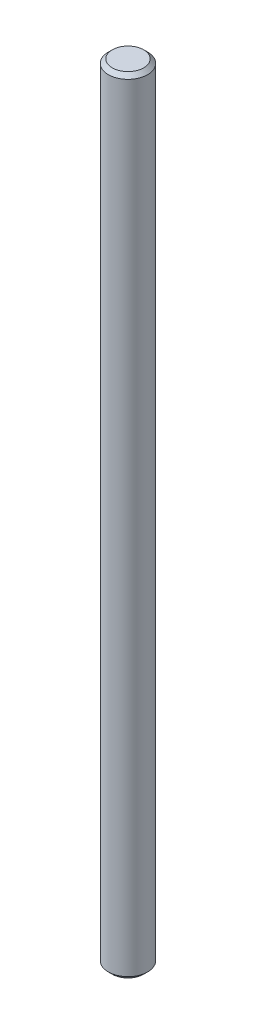
ISO-10303-21;
HEADER;
FILE_DESCRIPTION(('STEP AP214'),'2;1');
FILE_NAME('part.step','',(''),(''),'','','');
FILE_SCHEMA(('AUTOMOTIVE_DESIGN { 1 0 10303 214 1 1 1 1 }'));
ENDSEC;
DATA;
#1=APPLICATION_CONTEXT('core data for automotive mechanical design processes');
#2=APPLICATION_PROTOCOL_DEFINITION('international standard','automotive_design',2000,#1);
#3=PRODUCT_CONTEXT('',#1,'mechanical');
#4=PRODUCT('Part','Part','',(#3));
#5=PRODUCT_RELATED_PRODUCT_CATEGORY('part','',(#4));
#6=PRODUCT_DEFINITION_FORMATION('','',#4);
#7=PRODUCT_DEFINITION_CONTEXT('part definition',#1,'design');
#8=PRODUCT_DEFINITION('design','',#6,#7);
#9=PRODUCT_DEFINITION_SHAPE('','',#8);
#10=(LENGTH_UNIT() NAMED_UNIT(*) SI_UNIT(.MILLI.,.METRE.));
#11=(NAMED_UNIT(*) PLANE_ANGLE_UNIT() SI_UNIT($,.RADIAN.));
#12=(NAMED_UNIT(*) SI_UNIT($,.STERADIAN.) SOLID_ANGLE_UNIT());
#13=UNCERTAINTY_MEASURE_WITH_UNIT(LENGTH_MEASURE(1.E-05),#10,'distance_accuracy_value','');
#14=(GEOMETRIC_REPRESENTATION_CONTEXT(3) GLOBAL_UNCERTAINTY_ASSIGNED_CONTEXT((#13)) GLOBAL_UNIT_ASSIGNED_CONTEXT((#10,
#11,#12)) REPRESENTATION_CONTEXT('',''));
#15=CARTESIAN_POINT('',(0.,0.,0.));
#16=DIRECTION('',(0.,0.,1.));
#17=DIRECTION('',(1.,0.,0.));
#18=AXIS2_PLACEMENT_3D('',#15,#16,#17);
#19=CARTESIAN_POINT('',(0.,200.,0.));
#20=DIRECTION('',(0.,-1.,0.));
#21=DIRECTION('',(0.,0.,-1.));
#22=AXIS2_PLACEMENT_3D('',#19,#20,#21);
#23=CYLINDRICAL_SURFACE('',#22,5.);
#24=CARTESIAN_POINT('',(0.,0.999999999999945,0.));
#25=DIRECTION('',(0.,1.,0.));
#26=DIRECTION('',(0.,0.,1.));
#27=AXIS2_PLACEMENT_3D('',#24,#25,#26);
#28=CIRCLE('',#27,5.);
#29=CARTESIAN_POINT('',(0.,0.999999999999945,5.));
#30=VERTEX_POINT('',#29);
#31=EDGE_CURVE('E53',#30,#30,#28,.T.);
#32=ORIENTED_EDGE('',*,*,#31,.T.);
#33=EDGE_LOOP('',(#32));
#34=FACE_BOUND('',#33,.T.);
#35=CARTESIAN_POINT('',(0.,199.,0.));
#36=DIRECTION('',(0.,1.,0.));
#37=DIRECTION('',(0.,0.,1.));
#38=AXIS2_PLACEMENT_3D('',#35,#36,#37);
#39=CIRCLE('',#38,5.);
#40=CARTESIAN_POINT('',(0.,199.,5.));
#41=VERTEX_POINT('',#40);
#42=EDGE_CURVE('E57',#41,#41,#39,.F.);
#43=ORIENTED_EDGE('',*,*,#42,.T.);
#44=EDGE_LOOP('',(#43));
#45=FACE_BOUND('',#44,.T.);
#46=ADVANCED_FACE('F41',(#34,#45),#23,.T.);
#47=CARTESIAN_POINT('',(0.,200.,0.));
#48=DIRECTION('',(0.,1.,0.));
#49=DIRECTION('',(0.,0.,1.));
#50=AXIS2_PLACEMENT_3D('',#47,#48,#49);
#51=PLANE('',#50);
#52=CARTESIAN_POINT('',(0.,200.,0.));
#53=DIRECTION('',(0.,1.,0.));
#54=DIRECTION('',(0.,0.,1.));
#55=AXIS2_PLACEMENT_3D('',#52,#53,#54);
#56=CIRCLE('',#55,4.);
#57=CARTESIAN_POINT('',(0.,200.,4.));
#58=VERTEX_POINT('',#57);
#59=EDGE_CURVE('E10',#58,#58,#56,.T.);
#60=ORIENTED_EDGE('',*,*,#59,.T.);
#61=EDGE_LOOP('',(#60));
#62=FACE_BOUND('',#61,.T.);
#63=ADVANCED_FACE('F73',(#62),#51,.T.);
#64=CARTESIAN_POINT('',(0.,0.,0.));
#65=DIRECTION('',(0.,1.,0.));
#66=DIRECTION('',(0.,0.,1.));
#67=AXIS2_PLACEMENT_3D('',#64,#65,#66);
#68=PLANE('',#67);
#69=CARTESIAN_POINT('',(0.,0.,0.));
#70=DIRECTION('',(0.,1.,0.));
#71=DIRECTION('',(0.,0.,1.));
#72=AXIS2_PLACEMENT_3D('',#69,#70,#71);
#73=CIRCLE('',#72,4.00000000000003);
#74=CARTESIAN_POINT('',(0.,0.,4.00000000000003));
#75=VERTEX_POINT('',#74);
#76=EDGE_CURVE('E49',#75,#75,#73,.F.);
#77=ORIENTED_EDGE('',*,*,#76,.T.);
#78=EDGE_LOOP('',(#77));
#79=FACE_BOUND('',#78,.T.);
#80=ADVANCED_FACE('F70',(#79),#68,.F.);
#81=CARTESIAN_POINT('',(0.,0.999999999999945,0.));
#82=DIRECTION('',(0.,1.,0.));
#83=DIRECTION('',(0.,0.,1.));
#84=AXIS2_PLACEMENT_3D('',#81,#82,#83);
#85=CONICAL_SURFACE('',#84,5.,0.78539816339746);
#86=ORIENTED_EDGE('',*,*,#76,.F.);
#87=EDGE_LOOP('',(#86));
#88=FACE_BOUND('',#87,.T.);
#89=ORIENTED_EDGE('',*,*,#31,.F.);
#90=EDGE_LOOP('',(#89));
#91=FACE_BOUND('',#90,.T.);
#92=ADVANCED_FACE('F66',(#88,#91),#85,.T.);
#93=CARTESIAN_POINT('',(0.,200.,0.));
#94=DIRECTION('',(0.,-1.,0.));
#95=DIRECTION('',(0.,0.,-1.));
#96=AXIS2_PLACEMENT_3D('',#93,#94,#95);
#97=CONICAL_SURFACE('',#96,4.,0.78539816339746);
#98=ORIENTED_EDGE('',*,*,#42,.F.);
#99=EDGE_LOOP('',(#98));
#100=FACE_BOUND('',#99,.T.);
#101=ORIENTED_EDGE('',*,*,#59,.F.);
#102=EDGE_LOOP('',(#101));
#103=FACE_BOUND('',#102,.T.);
#104=ADVANCED_FACE('F44',(#100,#103),#97,.T.);
#105=CLOSED_SHELL('',(#46,#63,#80,#92,#104));
#106=MANIFOLD_SOLID_BREP('B2',#105);
#107=ADVANCED_BREP_SHAPE_REPRESENTATION('',(#18,#106),#14);
#108=SHAPE_DEFINITION_REPRESENTATION(#9,#107);
ENDSEC;
END-ISO-10303-21;
